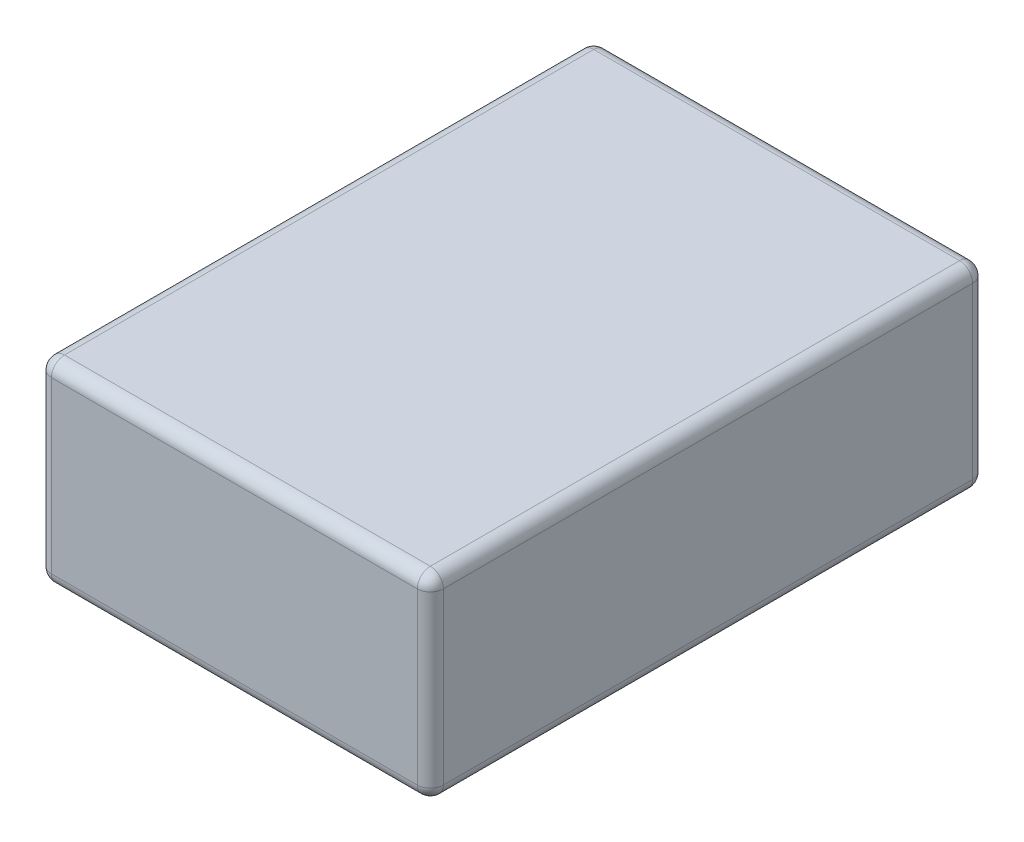
ISO-10303-21;
HEADER;
FILE_DESCRIPTION(('STEP AP214'),'2;1');
FILE_NAME('part.step','',(''),(''),'','','');
FILE_SCHEMA(('AUTOMOTIVE_DESIGN { 1 0 10303 214 1 1 1 1 }'));
ENDSEC;
DATA;
#1=APPLICATION_CONTEXT('core data for automotive mechanical design processes');
#2=APPLICATION_PROTOCOL_DEFINITION('international standard','automotive_design',2000,#1);
#3=PRODUCT_CONTEXT('',#1,'mechanical');
#4=PRODUCT('Part','Part','',(#3));
#5=PRODUCT_RELATED_PRODUCT_CATEGORY('part','',(#4));
#6=PRODUCT_DEFINITION_FORMATION('','',#4);
#7=PRODUCT_DEFINITION_CONTEXT('part definition',#1,'design');
#8=PRODUCT_DEFINITION('design','',#6,#7);
#9=PRODUCT_DEFINITION_SHAPE('','',#8);
#10=(LENGTH_UNIT() NAMED_UNIT(*) SI_UNIT(.MILLI.,.METRE.));
#11=(NAMED_UNIT(*) PLANE_ANGLE_UNIT() SI_UNIT($,.RADIAN.));
#12=(NAMED_UNIT(*) SI_UNIT($,.STERADIAN.) SOLID_ANGLE_UNIT());
#13=UNCERTAINTY_MEASURE_WITH_UNIT(LENGTH_MEASURE(1.E-05),#10,'distance_accuracy_value','');
#14=(GEOMETRIC_REPRESENTATION_CONTEXT(3) GLOBAL_UNCERTAINTY_ASSIGNED_CONTEXT((#13)) GLOBAL_UNIT_ASSIGNED_CONTEXT((#10,
#11,#12)) REPRESENTATION_CONTEXT('',''));
#15=CARTESIAN_POINT('',(0.,0.,0.));
#16=DIRECTION('',(0.,0.,1.));
#17=DIRECTION('',(1.,0.,0.));
#18=AXIS2_PLACEMENT_3D('',#15,#16,#17);
#19=CARTESIAN_POINT('',(-28.,30.,40.5));
#20=DIRECTION('',(0.,-1.,0.));
#21=DIRECTION('',(0.,0.,-1.));
#22=AXIS2_PLACEMENT_3D('',#19,#20,#21);
#23=CYLINDRICAL_SURFACE('',#22,2.);
#24=DIRECTION('',(0.,-1.,0.));
#25=VECTOR('',#24,1.);
#26=CARTESIAN_POINT('',(-30.,30.,40.5));
#27=LINE('',#26,#25);
#28=CARTESIAN_POINT('',(-30.,28.,40.5));
#29=VERTEX_POINT('',#28);
#30=CARTESIAN_POINT('',(-30.,2.,40.5));
#31=VERTEX_POINT('',#30);
#32=EDGE_CURVE('E266',#29,#31,#27,.T.);
#33=ORIENTED_EDGE('',*,*,#32,.T.);
#34=CARTESIAN_POINT('',(-28.,2.,40.5));
#35=DIRECTION('',(0.,-1.,0.));
#36=DIRECTION('',(0.,0.,-1.));
#37=AXIS2_PLACEMENT_3D('',#34,#35,#36);
#38=CIRCLE('',#37,2.);
#39=CARTESIAN_POINT('',(-28.,2.,42.5));
#40=VERTEX_POINT('',#39);
#41=EDGE_CURVE('E226',#31,#40,#38,.F.);
#42=ORIENTED_EDGE('',*,*,#41,.T.);
#43=DIRECTION('',(0.,-1.,0.));
#44=VECTOR('',#43,1.);
#45=CARTESIAN_POINT('',(-28.,30.,42.5));
#46=LINE('',#45,#44);
#47=CARTESIAN_POINT('',(-28.,28.,42.5));
#48=VERTEX_POINT('',#47);
#49=EDGE_CURVE('E154',#48,#40,#46,.T.);
#50=ORIENTED_EDGE('',*,*,#49,.F.);
#51=CARTESIAN_POINT('',(-28.,28.,40.5));
#52=DIRECTION('',(0.,-1.,0.));
#53=DIRECTION('',(0.,0.,-1.));
#54=AXIS2_PLACEMENT_3D('',#51,#52,#53);
#55=CIRCLE('',#54,2.);
#56=EDGE_CURVE('E223',#48,#29,#55,.T.);
#57=ORIENTED_EDGE('',*,*,#56,.T.);
#58=EDGE_LOOP('',(#33,#42,#50,#57));
#59=FACE_BOUND('',#58,.T.);
#60=ADVANCED_FACE('F39',(#59),#23,.T.);
#61=CARTESIAN_POINT('',(-28.,30.,42.5));
#62=DIRECTION('',(0.,0.,-1.));
#63=DIRECTION('',(-1.,0.,0.));
#64=AXIS2_PLACEMENT_3D('',#61,#62,#63);
#65=PLANE('',#64);
#66=ORIENTED_EDGE('',*,*,#49,.T.);
#67=DIRECTION('',(1.,0.,0.));
#68=VECTOR('',#67,1.);
#69=CARTESIAN_POINT('',(-28.,2.,42.5));
#70=LINE('',#69,#68);
#71=CARTESIAN_POINT('',(28.,2.,42.5));
#72=VERTEX_POINT('',#71);
#73=EDGE_CURVE('E152',#40,#72,#70,.T.);
#74=ORIENTED_EDGE('',*,*,#73,.T.);
#75=DIRECTION('',(0.,-1.,0.));
#76=VECTOR('',#75,1.);
#77=CARTESIAN_POINT('',(28.,30.,42.5));
#78=LINE('',#77,#76);
#79=CARTESIAN_POINT('',(28.,28.,42.5));
#80=VERTEX_POINT('',#79);
#81=EDGE_CURVE('E133',#80,#72,#78,.T.);
#82=ORIENTED_EDGE('',*,*,#81,.F.);
#83=DIRECTION('',(1.,0.,0.));
#84=VECTOR('',#83,1.);
#85=CARTESIAN_POINT('',(-28.,28.,42.5));
#86=LINE('',#85,#84);
#87=EDGE_CURVE('E149',#80,#48,#86,.F.);
#88=ORIENTED_EDGE('',*,*,#87,.T.);
#89=EDGE_LOOP('',(#66,#74,#82,#88));
#90=FACE_BOUND('',#89,.T.);
#91=ADVANCED_FACE('F147',(#90),#65,.F.);
#92=CARTESIAN_POINT('',(28.,30.,40.5));
#93=DIRECTION('',(0.,-1.,0.));
#94=DIRECTION('',(0.,0.,-1.));
#95=AXIS2_PLACEMENT_3D('',#92,#93,#94);
#96=CYLINDRICAL_SURFACE('',#95,2.);
#97=ORIENTED_EDGE('',*,*,#81,.T.);
#98=CARTESIAN_POINT('',(28.,2.,40.5));
#99=DIRECTION('',(0.,-1.,0.));
#100=DIRECTION('',(0.,0.,-1.));
#101=AXIS2_PLACEMENT_3D('',#98,#99,#100);
#102=CIRCLE('',#101,2.);
#103=CARTESIAN_POINT('',(30.,2.,40.5));
#104=VERTEX_POINT('',#103);
#105=EDGE_CURVE('E141',#72,#104,#102,.F.);
#106=ORIENTED_EDGE('',*,*,#105,.T.);
#107=DIRECTION('',(0.,-1.,0.));
#108=VECTOR('',#107,1.);
#109=CARTESIAN_POINT('',(30.,30.,40.5));
#110=LINE('',#109,#108);
#111=CARTESIAN_POINT('',(30.,28.,40.5));
#112=VERTEX_POINT('',#111);
#113=EDGE_CURVE('E135',#112,#104,#110,.T.);
#114=ORIENTED_EDGE('',*,*,#113,.F.);
#115=CARTESIAN_POINT('',(28.,28.,40.5));
#116=DIRECTION('',(0.,-1.,0.));
#117=DIRECTION('',(0.,0.,-1.));
#118=AXIS2_PLACEMENT_3D('',#115,#116,#117);
#119=CIRCLE('',#118,2.);
#120=EDGE_CURVE('E130',#112,#80,#119,.T.);
#121=ORIENTED_EDGE('',*,*,#120,.T.);
#122=EDGE_LOOP('',(#97,#106,#114,#121));
#123=FACE_BOUND('',#122,.T.);
#124=ADVANCED_FACE('F132',(#123),#96,.T.);
#125=CARTESIAN_POINT('',(30.,30.,-40.5));
#126=DIRECTION('',(-1.,0.,0.));
#127=DIRECTION('',(0.,0.,1.));
#128=AXIS2_PLACEMENT_3D('',#125,#126,#127);
#129=PLANE('',#128);
#130=ORIENTED_EDGE('',*,*,#113,.T.);
#131=DIRECTION('',(0.,0.,-1.));
#132=VECTOR('',#131,1.);
#133=CARTESIAN_POINT('',(30.,2.,-40.5));
#134=LINE('',#133,#132);
#135=CARTESIAN_POINT('',(30.,2.,-40.5));
#136=VERTEX_POINT('',#135);
#137=EDGE_CURVE('E195',#104,#136,#134,.T.);
#138=ORIENTED_EDGE('',*,*,#137,.T.);
#139=DIRECTION('',(0.,-1.,0.));
#140=VECTOR('',#139,1.);
#141=CARTESIAN_POINT('',(30.,30.,-40.5));
#142=LINE('',#141,#140);
#143=CARTESIAN_POINT('',(30.,28.,-40.5));
#144=VERTEX_POINT('',#143);
#145=EDGE_CURVE('E294',#144,#136,#142,.T.);
#146=ORIENTED_EDGE('',*,*,#145,.F.);
#147=DIRECTION('',(0.,0.,-1.));
#148=VECTOR('',#147,1.);
#149=CARTESIAN_POINT('',(30.,28.,40.5));
#150=LINE('',#149,#148);
#151=EDGE_CURVE('E192',#144,#112,#150,.F.);
#152=ORIENTED_EDGE('',*,*,#151,.T.);
#153=EDGE_LOOP('',(#130,#138,#146,#152));
#154=FACE_BOUND('',#153,.T.);
#155=ADVANCED_FACE('F291',(#154),#129,.F.);
#156=CARTESIAN_POINT('',(28.,30.,-40.5));
#157=DIRECTION('',(0.,-1.,0.));
#158=DIRECTION('',(0.,0.,-1.));
#159=AXIS2_PLACEMENT_3D('',#156,#157,#158);
#160=CYLINDRICAL_SURFACE('',#159,2.);
#161=ORIENTED_EDGE('',*,*,#145,.T.);
#162=CARTESIAN_POINT('',(28.,2.,-40.5));
#163=DIRECTION('',(0.,-1.,0.));
#164=DIRECTION('',(0.,0.,-1.));
#165=AXIS2_PLACEMENT_3D('',#162,#163,#164);
#166=CIRCLE('',#165,2.);
#167=CARTESIAN_POINT('',(28.,2.,-42.5));
#168=VERTEX_POINT('',#167);
#169=EDGE_CURVE('E201',#136,#168,#166,.F.);
#170=ORIENTED_EDGE('',*,*,#169,.T.);
#171=DIRECTION('',(0.,-1.,0.));
#172=VECTOR('',#171,1.);
#173=CARTESIAN_POINT('',(28.,30.,-42.5));
#174=LINE('',#173,#172);
#175=CARTESIAN_POINT('',(28.,28.,-42.5));
#176=VERTEX_POINT('',#175);
#177=EDGE_CURVE('E298',#176,#168,#174,.T.);
#178=ORIENTED_EDGE('',*,*,#177,.F.);
#179=CARTESIAN_POINT('',(28.,28.,-40.5));
#180=DIRECTION('',(0.,-1.,0.));
#181=DIRECTION('',(0.,0.,-1.));
#182=AXIS2_PLACEMENT_3D('',#179,#180,#181);
#183=CIRCLE('',#182,2.);
#184=EDGE_CURVE('E198',#176,#144,#183,.T.);
#185=ORIENTED_EDGE('',*,*,#184,.T.);
#186=EDGE_LOOP('',(#161,#170,#178,#185));
#187=FACE_BOUND('',#186,.T.);
#188=ADVANCED_FACE('F345',(#187),#160,.T.);
#189=CARTESIAN_POINT('',(-28.,30.,-42.5));
#190=DIRECTION('',(0.,0.,1.));
#191=DIRECTION('',(1.,0.,0.));
#192=AXIS2_PLACEMENT_3D('',#189,#190,#191);
#193=PLANE('',#192);
#194=ORIENTED_EDGE('',*,*,#177,.T.);
#195=DIRECTION('',(-1.,0.,0.));
#196=VECTOR('',#195,1.);
#197=CARTESIAN_POINT('',(-28.,2.,-42.5));
#198=LINE('',#197,#196);
#199=CARTESIAN_POINT('',(-28.,2.,-42.5));
#200=VERTEX_POINT('',#199);
#201=EDGE_CURVE('E207',#168,#200,#198,.T.);
#202=ORIENTED_EDGE('',*,*,#201,.T.);
#203=DIRECTION('',(0.,-1.,0.));
#204=VECTOR('',#203,1.);
#205=CARTESIAN_POINT('',(-28.,30.,-42.5));
#206=LINE('',#205,#204);
#207=CARTESIAN_POINT('',(-28.,28.,-42.5));
#208=VERTEX_POINT('',#207);
#209=EDGE_CURVE('E304',#208,#200,#206,.T.);
#210=ORIENTED_EDGE('',*,*,#209,.F.);
#211=DIRECTION('',(-1.,0.,0.));
#212=VECTOR('',#211,1.);
#213=CARTESIAN_POINT('',(28.,28.,-42.5));
#214=LINE('',#213,#212);
#215=EDGE_CURVE('E204',#208,#176,#214,.F.);
#216=ORIENTED_EDGE('',*,*,#215,.T.);
#217=EDGE_LOOP('',(#194,#202,#210,#216));
#218=FACE_BOUND('',#217,.T.);
#219=ADVANCED_FACE('F348',(#218),#193,.F.);
#220=CARTESIAN_POINT('',(-28.,30.,-40.5));
#221=DIRECTION('',(0.,-1.,0.));
#222=DIRECTION('',(0.,0.,-1.));
#223=AXIS2_PLACEMENT_3D('',#220,#221,#222);
#224=CYLINDRICAL_SURFACE('',#223,2.);
#225=ORIENTED_EDGE('',*,*,#209,.T.);
#226=CARTESIAN_POINT('',(-28.,2.,-40.5));
#227=DIRECTION('',(0.,-1.,0.));
#228=DIRECTION('',(0.,0.,-1.));
#229=AXIS2_PLACEMENT_3D('',#226,#227,#228);
#230=CIRCLE('',#229,2.);
#231=CARTESIAN_POINT('',(-30.,2.,-40.5));
#232=VERTEX_POINT('',#231);
#233=EDGE_CURVE('E213',#200,#232,#230,.F.);
#234=ORIENTED_EDGE('',*,*,#233,.T.);
#235=DIRECTION('',(0.,-1.,0.));
#236=VECTOR('',#235,1.);
#237=CARTESIAN_POINT('',(-30.,30.,-40.5));
#238=LINE('',#237,#236);
#239=CARTESIAN_POINT('',(-30.,28.,-40.5));
#240=VERTEX_POINT('',#239);
#241=EDGE_CURVE('E310',#240,#232,#238,.T.);
#242=ORIENTED_EDGE('',*,*,#241,.F.);
#243=CARTESIAN_POINT('',(-28.,28.,-40.5));
#244=DIRECTION('',(0.,-1.,0.));
#245=DIRECTION('',(0.,0.,-1.));
#246=AXIS2_PLACEMENT_3D('',#243,#244,#245);
#247=CIRCLE('',#246,2.);
#248=EDGE_CURVE('E210',#240,#208,#247,.T.);
#249=ORIENTED_EDGE('',*,*,#248,.T.);
#250=EDGE_LOOP('',(#225,#234,#242,#249));
#251=FACE_BOUND('',#250,.T.);
#252=ADVANCED_FACE('F361',(#251),#224,.T.);
#253=CARTESIAN_POINT('',(-30.,30.,-40.5));
#254=DIRECTION('',(1.,0.,0.));
#255=DIRECTION('',(0.,0.,-1.));
#256=AXIS2_PLACEMENT_3D('',#253,#254,#255);
#257=PLANE('',#256);
#258=ORIENTED_EDGE('',*,*,#241,.T.);
#259=DIRECTION('',(0.,0.,1.));
#260=VECTOR('',#259,1.);
#261=CARTESIAN_POINT('',(-30.,2.,-40.5));
#262=LINE('',#261,#260);
#263=EDGE_CURVE('E220',#232,#31,#262,.T.);
#264=ORIENTED_EDGE('',*,*,#263,.T.);
#265=ORIENTED_EDGE('',*,*,#32,.F.);
#266=DIRECTION('',(0.,0.,1.));
#267=VECTOR('',#266,1.);
#268=CARTESIAN_POINT('',(-30.,28.,-40.5));
#269=LINE('',#268,#267);
#270=EDGE_CURVE('E216',#29,#240,#269,.F.);
#271=ORIENTED_EDGE('',*,*,#270,.T.);
#272=EDGE_LOOP('',(#258,#264,#265,#271));
#273=FACE_BOUND('',#272,.T.);
#274=ADVANCED_FACE('F362',(#273),#257,.F.);
#275=CARTESIAN_POINT('',(-28.,30.,40.5));
#276=DIRECTION('',(0.,1.,0.));
#277=DIRECTION('',(0.,0.,1.));
#278=AXIS2_PLACEMENT_3D('',#275,#276,#277);
#279=PLANE('',#278);
#280=DIRECTION('',(-1.,0.,0.));
#281=VECTOR('',#280,1.);
#282=CARTESIAN_POINT('',(-28.,30.,-40.5));
#283=LINE('',#282,#281);
#284=CARTESIAN_POINT('',(28.,30.,-40.5));
#285=VERTEX_POINT('',#284);
#286=CARTESIAN_POINT('',(-28.,30.,-40.5));
#287=VERTEX_POINT('',#286);
#288=EDGE_CURVE('E49',#285,#287,#283,.T.);
#289=ORIENTED_EDGE('',*,*,#288,.T.);
#290=DIRECTION('',(0.,0.,1.));
#291=VECTOR('',#290,1.);
#292=CARTESIAN_POINT('',(-28.,30.,40.5));
#293=LINE('',#292,#291);
#294=CARTESIAN_POINT('',(-28.,30.,40.5));
#295=VERTEX_POINT('',#294);
#296=EDGE_CURVE('E11',#287,#295,#293,.T.);
#297=ORIENTED_EDGE('',*,*,#296,.T.);
#298=DIRECTION('',(1.,0.,0.));
#299=VECTOR('',#298,1.);
#300=CARTESIAN_POINT('',(28.,30.,40.5));
#301=LINE('',#300,#299);
#302=CARTESIAN_POINT('',(28.,30.,40.5));
#303=VERTEX_POINT('',#302);
#304=EDGE_CURVE('E229',#295,#303,#301,.T.);
#305=ORIENTED_EDGE('',*,*,#304,.T.);
#306=DIRECTION('',(0.,0.,-1.));
#307=VECTOR('',#306,1.);
#308=CARTESIAN_POINT('',(28.,30.,-40.5));
#309=LINE('',#308,#307);
#310=EDGE_CURVE('E60',#303,#285,#309,.T.);
#311=ORIENTED_EDGE('',*,*,#310,.T.);
#312=EDGE_LOOP('',(#289,#297,#305,#311));
#313=FACE_BOUND('',#312,.T.);
#314=ADVANCED_FACE('F371',(#313),#279,.T.);
#315=CARTESIAN_POINT('',(-28.,0.,40.5));
#316=DIRECTION('',(0.,1.,0.));
#317=DIRECTION('',(0.,0.,1.));
#318=AXIS2_PLACEMENT_3D('',#315,#316,#317);
#319=PLANE('',#318);
#320=DIRECTION('',(0.,0.,-1.));
#321=VECTOR('',#320,1.);
#322=CARTESIAN_POINT('',(28.,0.,40.5));
#323=LINE('',#322,#321);
#324=CARTESIAN_POINT('',(28.,0.,-40.5));
#325=VERTEX_POINT('',#324);
#326=CARTESIAN_POINT('',(28.,0.,40.5));
#327=VERTEX_POINT('',#326);
#328=EDGE_CURVE('E184',#325,#327,#323,.F.);
#329=ORIENTED_EDGE('',*,*,#328,.T.);
#330=DIRECTION('',(1.,0.,0.));
#331=VECTOR('',#330,1.);
#332=CARTESIAN_POINT('',(-28.,0.,40.5));
#333=LINE('',#332,#331);
#334=CARTESIAN_POINT('',(-28.,0.,40.5));
#335=VERTEX_POINT('',#334);
#336=EDGE_CURVE('E142',#327,#335,#333,.F.);
#337=ORIENTED_EDGE('',*,*,#336,.T.);
#338=DIRECTION('',(0.,0.,1.));
#339=VECTOR('',#338,1.);
#340=CARTESIAN_POINT('',(-28.,0.,40.5));
#341=LINE('',#340,#339);
#342=CARTESIAN_POINT('',(-28.,0.,-40.5));
#343=VERTEX_POINT('',#342);
#344=EDGE_CURVE('E175',#335,#343,#341,.F.);
#345=ORIENTED_EDGE('',*,*,#344,.T.);
#346=DIRECTION('',(-1.,0.,0.));
#347=VECTOR('',#346,1.);
#348=CARTESIAN_POINT('',(-28.,0.,-40.5));
#349=LINE('',#348,#347);
#350=EDGE_CURVE('E181',#343,#325,#349,.F.);
#351=ORIENTED_EDGE('',*,*,#350,.T.);
#352=EDGE_LOOP('',(#329,#337,#345,#351));
#353=FACE_BOUND('',#352,.T.);
#354=ADVANCED_FACE('F373',(#353),#319,.F.);
#355=CARTESIAN_POINT('',(-28.,2.,-40.5));
#356=DIRECTION('',(-1.,0.,0.));
#357=DIRECTION('',(0.,0.,1.));
#358=AXIS2_PLACEMENT_3D('',#355,#356,#357);
#359=CYLINDRICAL_SURFACE('',#358,2.);
#360=CARTESIAN_POINT('',(-28.,2.,-40.5));
#361=DIRECTION('',(-1.,0.,0.));
#362=DIRECTION('',(0.,0.,1.));
#363=AXIS2_PLACEMENT_3D('',#360,#361,#362);
#364=CIRCLE('',#363,2.);
#365=EDGE_CURVE('E262',#200,#343,#364,.T.);
#366=ORIENTED_EDGE('',*,*,#365,.F.);
#367=ORIENTED_EDGE('',*,*,#201,.F.);
#368=CARTESIAN_POINT('',(28.,2.,-40.5));
#369=DIRECTION('',(1.,0.,0.));
#370=DIRECTION('',(0.,0.,-1.));
#371=AXIS2_PLACEMENT_3D('',#368,#369,#370);
#372=CIRCLE('',#371,2.);
#373=EDGE_CURVE('E258',#325,#168,#372,.T.);
#374=ORIENTED_EDGE('',*,*,#373,.F.);
#375=ORIENTED_EDGE('',*,*,#350,.F.);
#376=EDGE_LOOP('',(#366,#367,#374,#375));
#377=FACE_BOUND('',#376,.T.);
#378=ADVANCED_FACE('F353',(#377),#359,.T.);
#379=CARTESIAN_POINT('',(-28.,2.,-40.5));
#380=DIRECTION('',(0.,1.,0.));
#381=DIRECTION('',(0.,0.,1.));
#382=AXIS2_PLACEMENT_3D('',#379,#380,#381);
#383=SPHERICAL_SURFACE('',#382,2.);
#384=ORIENTED_EDGE('',*,*,#233,.F.);
#385=ORIENTED_EDGE('',*,*,#365,.T.);
#386=CARTESIAN_POINT('',(-28.,2.,-40.5));
#387=DIRECTION('',(0.,0.,1.));
#388=DIRECTION('',(1.,0.,0.));
#389=AXIS2_PLACEMENT_3D('',#386,#387,#388);
#390=CIRCLE('',#389,2.);
#391=EDGE_CURVE('E254',#232,#343,#390,.T.);
#392=ORIENTED_EDGE('',*,*,#391,.F.);
#393=EDGE_LOOP('',(#384,#385,#392));
#394=FACE_BOUND('',#393,.T.);
#395=ADVANCED_FACE('F358',(#394),#383,.T.);
#396=CARTESIAN_POINT('',(28.,2.,-40.5));
#397=DIRECTION('',(0.,1.,0.));
#398=DIRECTION('',(0.,0.,1.));
#399=AXIS2_PLACEMENT_3D('',#396,#397,#398);
#400=SPHERICAL_SURFACE('',#399,2.);
#401=ORIENTED_EDGE('',*,*,#373,.T.);
#402=ORIENTED_EDGE('',*,*,#169,.F.);
#403=CARTESIAN_POINT('',(28.,2.,-40.5));
#404=DIRECTION('',(0.,0.,1.));
#405=DIRECTION('',(1.,0.,0.));
#406=AXIS2_PLACEMENT_3D('',#403,#404,#405);
#407=CIRCLE('',#406,2.);
#408=EDGE_CURVE('E250',#325,#136,#407,.T.);
#409=ORIENTED_EDGE('',*,*,#408,.F.);
#410=EDGE_LOOP('',(#401,#402,#409));
#411=FACE_BOUND('',#410,.T.);
#412=ADVANCED_FACE('F342',(#411),#400,.T.);
#413=CARTESIAN_POINT('',(-28.,2.,-40.5));
#414=DIRECTION('',(0.,0.,1.));
#415=DIRECTION('',(1.,0.,0.));
#416=AXIS2_PLACEMENT_3D('',#413,#414,#415);
#417=CYLINDRICAL_SURFACE('',#416,2.);
#418=ORIENTED_EDGE('',*,*,#391,.T.);
#419=ORIENTED_EDGE('',*,*,#344,.F.);
#420=CARTESIAN_POINT('',(-28.,2.,40.5));
#421=DIRECTION('',(0.,0.,1.));
#422=DIRECTION('',(1.,0.,0.));
#423=AXIS2_PLACEMENT_3D('',#420,#421,#422);
#424=CIRCLE('',#423,2.);
#425=EDGE_CURVE('E246',#31,#335,#424,.T.);
#426=ORIENTED_EDGE('',*,*,#425,.F.);
#427=ORIENTED_EDGE('',*,*,#263,.F.);
#428=EDGE_LOOP('',(#418,#419,#426,#427));
#429=FACE_BOUND('',#428,.T.);
#430=ADVANCED_FACE('F325',(#429),#417,.T.);
#431=CARTESIAN_POINT('',(28.,2.,-40.5));
#432=DIRECTION('',(0.,0.,-1.));
#433=DIRECTION('',(-1.,0.,0.));
#434=AXIS2_PLACEMENT_3D('',#431,#432,#433);
#435=CYLINDRICAL_SURFACE('',#434,2.);
#436=ORIENTED_EDGE('',*,*,#408,.T.);
#437=ORIENTED_EDGE('',*,*,#137,.F.);
#438=CARTESIAN_POINT('',(28.,2.,40.5));
#439=DIRECTION('',(0.,0.,1.));
#440=DIRECTION('',(1.,0.,0.));
#441=AXIS2_PLACEMENT_3D('',#438,#439,#440);
#442=CIRCLE('',#441,2.);
#443=EDGE_CURVE('E242',#327,#104,#442,.T.);
#444=ORIENTED_EDGE('',*,*,#443,.F.);
#445=ORIENTED_EDGE('',*,*,#328,.F.);
#446=EDGE_LOOP('',(#436,#437,#444,#445));
#447=FACE_BOUND('',#446,.T.);
#448=ADVANCED_FACE('F339',(#447),#435,.T.);
#449=CARTESIAN_POINT('',(-28.,2.,40.5));
#450=DIRECTION('',(0.,1.,0.));
#451=DIRECTION('',(0.,0.,1.));
#452=AXIS2_PLACEMENT_3D('',#449,#450,#451);
#453=SPHERICAL_SURFACE('',#452,2.);
#454=ORIENTED_EDGE('',*,*,#41,.F.);
#455=ORIENTED_EDGE('',*,*,#425,.T.);
#456=CARTESIAN_POINT('',(-28.,2.,40.5));
#457=DIRECTION('',(1.,0.,0.));
#458=DIRECTION('',(0.,0.,-1.));
#459=AXIS2_PLACEMENT_3D('',#456,#457,#458);
#460=CIRCLE('',#459,2.);
#461=EDGE_CURVE('E239',#40,#335,#460,.T.);
#462=ORIENTED_EDGE('',*,*,#461,.F.);
#463=EDGE_LOOP('',(#454,#455,#462));
#464=FACE_BOUND('',#463,.T.);
#465=ADVANCED_FACE('F328',(#464),#453,.T.);
#466=CARTESIAN_POINT('',(28.,2.,40.5));
#467=DIRECTION('',(0.,1.,0.));
#468=DIRECTION('',(0.,0.,1.));
#469=AXIS2_PLACEMENT_3D('',#466,#467,#468);
#470=SPHERICAL_SURFACE('',#469,2.);
#471=ORIENTED_EDGE('',*,*,#443,.T.);
#472=ORIENTED_EDGE('',*,*,#105,.F.);
#473=CARTESIAN_POINT('',(28.,2.,40.5));
#474=DIRECTION('',(-1.,0.,0.));
#475=DIRECTION('',(0.,0.,1.));
#476=AXIS2_PLACEMENT_3D('',#473,#474,#475);
#477=CIRCLE('',#476,2.);
#478=EDGE_CURVE('E236',#327,#72,#477,.T.);
#479=ORIENTED_EDGE('',*,*,#478,.F.);
#480=EDGE_LOOP('',(#471,#472,#479));
#481=FACE_BOUND('',#480,.T.);
#482=ADVANCED_FACE('F335',(#481),#470,.T.);
#483=CARTESIAN_POINT('',(-28.,2.,40.5));
#484=DIRECTION('',(1.,0.,0.));
#485=DIRECTION('',(0.,0.,-1.));
#486=AXIS2_PLACEMENT_3D('',#483,#484,#485);
#487=CYLINDRICAL_SURFACE('',#486,2.);
#488=ORIENTED_EDGE('',*,*,#461,.T.);
#489=ORIENTED_EDGE('',*,*,#336,.F.);
#490=ORIENTED_EDGE('',*,*,#478,.T.);
#491=ORIENTED_EDGE('',*,*,#73,.F.);
#492=EDGE_LOOP('',(#488,#489,#490,#491));
#493=FACE_BOUND('',#492,.T.);
#494=ADVANCED_FACE('F331',(#493),#487,.T.);
#495=CARTESIAN_POINT('',(28.,28.,40.5));
#496=DIRECTION('',(0.,0.,1.));
#497=DIRECTION('',(1.,0.,0.));
#498=AXIS2_PLACEMENT_3D('',#495,#496,#497);
#499=CYLINDRICAL_SURFACE('',#498,2.);
#500=CARTESIAN_POINT('',(28.,28.,40.5));
#501=DIRECTION('',(0.,0.,1.));
#502=DIRECTION('',(1.,0.,0.));
#503=AXIS2_PLACEMENT_3D('',#500,#501,#502);
#504=CIRCLE('',#503,2.);
#505=EDGE_CURVE('E159',#112,#303,#504,.T.);
#506=ORIENTED_EDGE('',*,*,#505,.F.);
#507=ORIENTED_EDGE('',*,*,#151,.F.);
#508=CARTESIAN_POINT('',(28.,28.,-40.5));
#509=DIRECTION('',(0.,0.,-1.));
#510=DIRECTION('',(-1.,0.,0.));
#511=AXIS2_PLACEMENT_3D('',#508,#509,#510);
#512=CIRCLE('',#511,2.);
#513=EDGE_CURVE('E43',#285,#144,#512,.T.);
#514=ORIENTED_EDGE('',*,*,#513,.F.);
#515=ORIENTED_EDGE('',*,*,#310,.F.);
#516=EDGE_LOOP('',(#506,#507,#514,#515));
#517=FACE_BOUND('',#516,.T.);
#518=ADVANCED_FACE('F41',(#517),#499,.T.);
#519=CARTESIAN_POINT('',(28.,28.,-40.5));
#520=DIRECTION('',(0.,1.,0.));
#521=DIRECTION('',(0.,0.,1.));
#522=AXIS2_PLACEMENT_3D('',#519,#520,#521);
#523=SPHERICAL_SURFACE('',#522,2.);
#524=ORIENTED_EDGE('',*,*,#513,.T.);
#525=ORIENTED_EDGE('',*,*,#184,.F.);
#526=CARTESIAN_POINT('',(28.,28.,-40.5));
#527=DIRECTION('',(-1.,0.,0.));
#528=DIRECTION('',(0.,0.,1.));
#529=AXIS2_PLACEMENT_3D('',#526,#527,#528);
#530=CIRCLE('',#529,2.);
#531=EDGE_CURVE('E163',#285,#176,#530,.T.);
#532=ORIENTED_EDGE('',*,*,#531,.F.);
#533=EDGE_LOOP('',(#524,#525,#532));
#534=FACE_BOUND('',#533,.T.);
#535=ADVANCED_FACE('F286',(#534),#523,.T.);
#536=CARTESIAN_POINT('',(28.,28.,40.5));
#537=DIRECTION('',(0.,1.,0.));
#538=DIRECTION('',(0.,0.,1.));
#539=AXIS2_PLACEMENT_3D('',#536,#537,#538);
#540=SPHERICAL_SURFACE('',#539,2.);
#541=ORIENTED_EDGE('',*,*,#120,.F.);
#542=ORIENTED_EDGE('',*,*,#505,.T.);
#543=CARTESIAN_POINT('',(28.,28.,40.5));
#544=DIRECTION('',(-1.,0.,0.));
#545=DIRECTION('',(0.,0.,1.));
#546=AXIS2_PLACEMENT_3D('',#543,#544,#545);
#547=CIRCLE('',#546,2.);
#548=EDGE_CURVE('E157',#80,#303,#547,.T.);
#549=ORIENTED_EDGE('',*,*,#548,.F.);
#550=EDGE_LOOP('',(#541,#542,#549));
#551=FACE_BOUND('',#550,.T.);
#552=ADVANCED_FACE('F158',(#551),#540,.T.);
#553=CARTESIAN_POINT('',(-28.,28.,-40.5));
#554=DIRECTION('',(1.,0.,0.));
#555=DIRECTION('',(0.,0.,-1.));
#556=AXIS2_PLACEMENT_3D('',#553,#554,#555);
#557=CYLINDRICAL_SURFACE('',#556,2.);
#558=ORIENTED_EDGE('',*,*,#531,.T.);
#559=ORIENTED_EDGE('',*,*,#215,.F.);
#560=CARTESIAN_POINT('',(-28.,28.,-40.5));
#561=DIRECTION('',(-1.,0.,0.));
#562=DIRECTION('',(0.,0.,1.));
#563=AXIS2_PLACEMENT_3D('',#560,#561,#562);
#564=CIRCLE('',#563,2.);
#565=EDGE_CURVE('E164',#287,#208,#564,.T.);
#566=ORIENTED_EDGE('',*,*,#565,.F.);
#567=ORIENTED_EDGE('',*,*,#288,.F.);
#568=EDGE_LOOP('',(#558,#559,#566,#567));
#569=FACE_BOUND('',#568,.T.);
#570=ADVANCED_FACE('F416',(#569),#557,.T.);
#571=CARTESIAN_POINT('',(-28.,28.,40.5));
#572=DIRECTION('',(-1.,0.,0.));
#573=DIRECTION('',(0.,0.,1.));
#574=AXIS2_PLACEMENT_3D('',#571,#572,#573);
#575=CYLINDRICAL_SURFACE('',#574,2.);
#576=ORIENTED_EDGE('',*,*,#548,.T.);
#577=ORIENTED_EDGE('',*,*,#304,.F.);
#578=CARTESIAN_POINT('',(-28.,28.,40.5));
#579=DIRECTION('',(-1.,0.,0.));
#580=DIRECTION('',(0.,0.,1.));
#581=AXIS2_PLACEMENT_3D('',#578,#579,#580);
#582=CIRCLE('',#581,2.);
#583=EDGE_CURVE('E169',#48,#295,#582,.T.);
#584=ORIENTED_EDGE('',*,*,#583,.F.);
#585=ORIENTED_EDGE('',*,*,#87,.F.);
#586=EDGE_LOOP('',(#576,#577,#584,#585));
#587=FACE_BOUND('',#586,.T.);
#588=ADVANCED_FACE('F167',(#587),#575,.T.);
#589=CARTESIAN_POINT('',(-28.,28.,-40.5));
#590=DIRECTION('',(0.,1.,0.));
#591=DIRECTION('',(0.,0.,1.));
#592=AXIS2_PLACEMENT_3D('',#589,#590,#591);
#593=SPHERICAL_SURFACE('',#592,2.);
#594=ORIENTED_EDGE('',*,*,#565,.T.);
#595=ORIENTED_EDGE('',*,*,#248,.F.);
#596=CARTESIAN_POINT('',(-28.,28.,-40.5));
#597=DIRECTION('',(0.,0.,1.));
#598=DIRECTION('',(1.,0.,0.));
#599=AXIS2_PLACEMENT_3D('',#596,#597,#598);
#600=CIRCLE('',#599,2.);
#601=EDGE_CURVE('E270',#287,#240,#600,.T.);
#602=ORIENTED_EDGE('',*,*,#601,.F.);
#603=EDGE_LOOP('',(#594,#595,#602));
#604=FACE_BOUND('',#603,.T.);
#605=ADVANCED_FACE('F410',(#604),#593,.T.);
#606=CARTESIAN_POINT('',(-28.,28.,40.5));
#607=DIRECTION('',(0.,1.,0.));
#608=DIRECTION('',(0.,0.,1.));
#609=AXIS2_PLACEMENT_3D('',#606,#607,#608);
#610=SPHERICAL_SURFACE('',#609,2.);
#611=ORIENTED_EDGE('',*,*,#56,.F.);
#612=ORIENTED_EDGE('',*,*,#583,.T.);
#613=CARTESIAN_POINT('',(-28.,28.,40.5));
#614=DIRECTION('',(0.,0.,-1.));
#615=DIRECTION('',(-1.,0.,0.));
#616=AXIS2_PLACEMENT_3D('',#613,#614,#615);
#617=CIRCLE('',#616,2.);
#618=EDGE_CURVE('E267',#29,#295,#617,.T.);
#619=ORIENTED_EDGE('',*,*,#618,.F.);
#620=EDGE_LOOP('',(#611,#612,#619));
#621=FACE_BOUND('',#620,.T.);
#622=ADVANCED_FACE('F370',(#621),#610,.T.);
#623=CARTESIAN_POINT('',(-28.,28.,40.5));
#624=DIRECTION('',(0.,0.,-1.));
#625=DIRECTION('',(-1.,0.,0.));
#626=AXIS2_PLACEMENT_3D('',#623,#624,#625);
#627=CYLINDRICAL_SURFACE('',#626,2.);
#628=ORIENTED_EDGE('',*,*,#601,.T.);
#629=ORIENTED_EDGE('',*,*,#270,.F.);
#630=ORIENTED_EDGE('',*,*,#618,.T.);
#631=ORIENTED_EDGE('',*,*,#296,.F.);
#632=EDGE_LOOP('',(#628,#629,#630,#631));
#633=FACE_BOUND('',#632,.T.);
#634=ADVANCED_FACE('F365',(#633),#627,.T.);
#635=CLOSED_SHELL('',(#60,#91,#124,#155,#188,#219,#252,#274,#314,#354,#378,#395,#412,#430,#448,
#465,#482,#494,#518,#535,#552,#570,#588,#605,#622,#634));
#636=MANIFOLD_SOLID_BREP('B2',#635);
#637=ADVANCED_BREP_SHAPE_REPRESENTATION('',(#18,#636),#14);
#638=SHAPE_DEFINITION_REPRESENTATION(#9,#637);
ENDSEC;
END-ISO-10303-21;
